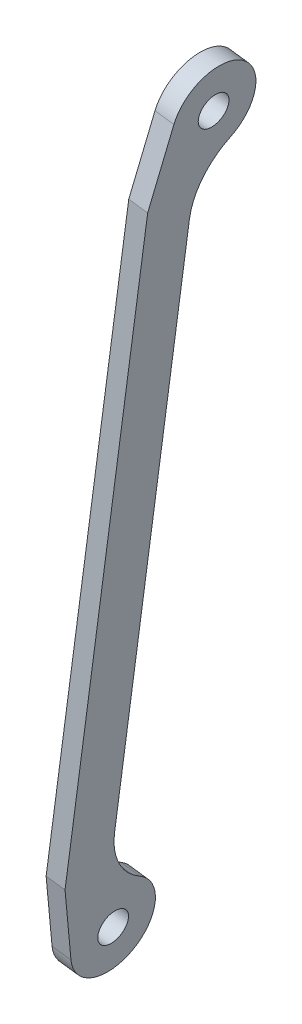
ISO-10303-21;
HEADER;
FILE_DESCRIPTION(('STEP AP214'),'2;1');
FILE_NAME('part.step','',(''),(''),'','','');
FILE_SCHEMA(('AUTOMOTIVE_DESIGN { 1 0 10303 214 1 1 1 1 }'));
ENDSEC;
DATA;
#1=APPLICATION_CONTEXT('core data for automotive mechanical design processes');
#2=APPLICATION_PROTOCOL_DEFINITION('international standard','automotive_design',2000,#1);
#3=PRODUCT_CONTEXT('',#1,'mechanical');
#4=PRODUCT('Part','Part','',(#3));
#5=PRODUCT_RELATED_PRODUCT_CATEGORY('part','',(#4));
#6=PRODUCT_DEFINITION_FORMATION('','',#4);
#7=PRODUCT_DEFINITION_CONTEXT('part definition',#1,'design');
#8=PRODUCT_DEFINITION('design','',#6,#7);
#9=PRODUCT_DEFINITION_SHAPE('','',#8);
#10=(LENGTH_UNIT() NAMED_UNIT(*) SI_UNIT(.MILLI.,.METRE.));
#11=(NAMED_UNIT(*) PLANE_ANGLE_UNIT() SI_UNIT($,.RADIAN.));
#12=(NAMED_UNIT(*) SI_UNIT($,.STERADIAN.) SOLID_ANGLE_UNIT());
#13=UNCERTAINTY_MEASURE_WITH_UNIT(LENGTH_MEASURE(1.E-05),#10,'distance_accuracy_value','');
#14=(GEOMETRIC_REPRESENTATION_CONTEXT(3) GLOBAL_UNCERTAINTY_ASSIGNED_CONTEXT((#13)) GLOBAL_UNIT_ASSIGNED_CONTEXT((#10,
#11,#12)) REPRESENTATION_CONTEXT('',''));
#15=CARTESIAN_POINT('',(0.,0.,0.));
#16=DIRECTION('',(0.,0.,1.));
#17=DIRECTION('',(1.,0.,0.));
#18=AXIS2_PLACEMENT_3D('',#15,#16,#17);
#19=CARTESIAN_POINT('',(87.6961179977007,-71.8034695407329,-15.1531103100848));
#20=DIRECTION('',(-0.991444861373949,0.130526192218997,0.));
#21=DIRECTION('',(0.,0.,1.));
#22=AXIS2_PLACEMENT_3D('',#19,#20,#21);
#23=PLANE('',#22);
#24=CARTESIAN_POINT('',(84.4687057995458,-96.3180990185285,0.));
#25=DIRECTION('',(-0.991444861373949,0.130526192218997,0.));
#26=DIRECTION('',(0.,0.,1.));
#27=AXIS2_PLACEMENT_3D('',#24,#25,#26);
#28=CIRCLE('',#27,4.);
#29=CARTESIAN_POINT('',(84.4687057995458,-96.3180990185285,4.));
#30=VERTEX_POINT('',#29);
#31=EDGE_CURVE('E149',#30,#30,#28,.T.);
#32=ORIENTED_EDGE('',*,*,#31,.F.);
#33=EDGE_LOOP('',(#32));
#34=FACE_BOUND('',#33,.T.);
#35=CARTESIAN_POINT('',(87.6961179977007,-71.8034695407329,-15.1531103100848));
#36=DIRECTION('',(0.991444861373949,-0.130526192218997,0.));
#37=DIRECTION('',(0.,0.,1.));
#38=AXIS2_PLACEMENT_3D('',#35,#36,#37);
#39=CIRCLE('',#38,18.);
#40=CARTESIAN_POINT('',(87.696117925,-71.8034700929494,2.84688968991517));
#41=VERTEX_POINT('',#40);
#42=CARTESIAN_POINT('',(85.6928966746381,-87.0194461442093,-5.74773098050502));
#43=VERTEX_POINT('',#42);
#44=EDGE_CURVE('E167',#41,#43,#39,.T.);
#45=ORIENTED_EDGE('',*,*,#44,.T.);
#46=CARTESIAN_POINT('',(84.4687057995458,-96.3180990185285,0.));
#47=DIRECTION('',(-0.991444861373949,0.130526192218997,0.));
#48=DIRECTION('',(0.,0.,1.));
#49=AXIS2_PLACEMENT_3D('',#46,#47,#48);
#50=CIRCLE('',#49,11.0000000000001);
#51=CARTESIAN_POINT('',(84.1724970722622,-98.5680276770371,10.763367568819));
#52=VERTEX_POINT('',#51);
#53=EDGE_CURVE('E103',#43,#52,#50,.T.);
#54=ORIENTED_EDGE('',*,*,#53,.T.);
#55=DIRECTION('',(0.127723485620426,0.970156191200915,0.206115685709511));
#56=VECTOR('',#55,1.);
#57=CARTESIAN_POINT('',(84.1724970722622,-98.5680276770371,10.763367568819));
#58=LINE('',#57,#56);
#59=CARTESIAN_POINT('',(86.7012930468845,-79.359915252399,14.8442499045684));
#60=VERTEX_POINT('',#59);
#61=EDGE_CURVE('E188',#52,#60,#58,.T.);
#62=ORIENTED_EDGE('',*,*,#61,.T.);
#63=DIRECTION('',(0.130526192218997,0.991444861373949,0.));
#64=VECTOR('',#63,1.);
#65=CARTESIAN_POINT('',(86.7012930468845,-79.359915252399,14.8442499045684));
#66=LINE('',#65,#64);
#67=CARTESIAN_POINT('',(108.368640955238,85.2199317356766,14.8442499045684));
#68=VERTEX_POINT('',#67);
#69=EDGE_CURVE('E202',#60,#68,#66,.T.);
#70=ORIENTED_EDGE('',*,*,#69,.T.);
#71=DIRECTION('',(0.127331001725769,0.967174980043877,-0.21990764874519));
#72=VECTOR('',#71,1.);
#73=CARTESIAN_POINT('',(108.368640955238,85.2199317356766,14.8442499045684));
#74=LINE('',#73,#72);
#75=CARTESIAN_POINT('',(110.889666168954,104.369019371201,10.4903005940179));
#76=VERTEX_POINT('',#75);
#77=EDGE_CURVE('E122',#68,#76,#74,.T.);
#78=ORIENTED_EDGE('',*,*,#77,.T.);
#79=CARTESIAN_POINT('',(110.573925380618,101.970729979623,-0.240427049009332));
#80=DIRECTION('',(-0.991444861373949,0.130526192218997,0.));
#81=DIRECTION('',(0.,0.,1.));
#82=AXIS2_PLACEMENT_3D('',#79,#80,#81);
#83=CIRCLE('',#82,11.0000000000001);
#84=CARTESIAN_POINT('',(109.342518624502,92.6172670473448,-5.89696031378309));
#85=VERTEX_POINT('',#84);
#86=EDGE_CURVE('E116',#76,#85,#83,.T.);
#87=ORIENTED_EDGE('',*,*,#86,.T.);
#88=CARTESIAN_POINT('',(107.327489387223,77.3116004308897,-15.1531056561401));
#89=DIRECTION('',(0.991444861373949,-0.130526192218997,0.));
#90=DIRECTION('',(0.,0.,1.));
#91=AXIS2_PLACEMENT_3D('',#88,#89,#90);
#92=CIRCLE('',#91,18.);
#93=CARTESIAN_POINT('',(107.327489314522,77.3115998786733,2.84689434385985));
#94=VERTEX_POINT('',#93);
#95=EDGE_CURVE('E120',#85,#94,#92,.T.);
#96=ORIENTED_EDGE('',*,*,#95,.T.);
#97=DIRECTION('',(-0.130526192218997,-0.991444861373949,-3.09434152639009E-08));
#98=VECTOR('',#97,1.);
#99=CARTESIAN_POINT('',(107.327489314522,77.3115998786733,2.84689434385985));
#100=LINE('',#99,#98);
#101=EDGE_CURVE('E60',#94,#41,#100,.T.);
#102=ORIENTED_EDGE('',*,*,#101,.T.);
#103=EDGE_LOOP('',(#45,#54,#62,#70,#78,#87,#96,#102));
#104=FACE_BOUND('',#103,.T.);
#105=CARTESIAN_POINT('',(110.573925380618,101.970729979623,-0.240427049009332));
#106=DIRECTION('',(-0.991444861373949,0.130526192218997,0.));
#107=DIRECTION('',(0.,0.,1.));
#108=AXIS2_PLACEMENT_3D('',#105,#106,#107);
#109=CIRCLE('',#108,3.99999999999999);
#110=CARTESIAN_POINT('',(110.573925380618,101.970729979623,3.75957295099066));
#111=VERTEX_POINT('',#110);
#112=EDGE_CURVE('E216',#111,#111,#109,.T.);
#113=ORIENTED_EDGE('',*,*,#112,.F.);
#114=EDGE_LOOP('',(#113));
#115=FACE_BOUND('',#114,.T.);
#116=ADVANCED_FACE('F42',(#34,#104,#115),#23,.T.);
#117=CARTESIAN_POINT('',(92.6533423045704,-72.4561005018279,-15.1531103100848));
#118=DIRECTION('',(-0.991444861373949,0.130526192218997,0.));
#119=DIRECTION('',(0.,0.,1.));
#120=AXIS2_PLACEMENT_3D('',#117,#118,#119);
#121=PLANE('',#120);
#122=CARTESIAN_POINT('',(92.6533423045704,-72.4561005018279,-15.1531103100848));
#123=DIRECTION('',(0.991444861373949,-0.130526192218997,0.));
#124=DIRECTION('',(0.,0.,1.));
#125=AXIS2_PLACEMENT_3D('',#122,#123,#124);
#126=CIRCLE('',#125,18.);
#127=CARTESIAN_POINT('',(92.6533422318697,-72.4561010540444,2.84688968991517));
#128=VERTEX_POINT('',#127);
#129=CARTESIAN_POINT('',(90.6501209815079,-87.6720771053043,-5.74773098050502));
#130=VERTEX_POINT('',#129);
#131=EDGE_CURVE('E144',#128,#130,#126,.T.);
#132=ORIENTED_EDGE('',*,*,#131,.F.);
#133=DIRECTION('',(-0.130526192218997,-0.991444861373949,-3.09434152639009E-08));
#134=VECTOR('',#133,1.);
#135=CARTESIAN_POINT('',(112.284713621392,76.6589689175783,2.84689434385985));
#136=LINE('',#135,#134);
#137=CARTESIAN_POINT('',(112.284713621392,76.6589689175783,2.84689434385985));
#138=VERTEX_POINT('',#137);
#139=EDGE_CURVE('E95',#138,#128,#136,.T.);
#140=ORIENTED_EDGE('',*,*,#139,.F.);
#141=CARTESIAN_POINT('',(112.284713694092,76.6589694697947,-15.1531056561401));
#142=DIRECTION('',(0.991444861373949,-0.130526192218997,0.));
#143=DIRECTION('',(0.,0.,1.));
#144=AXIS2_PLACEMENT_3D('',#141,#142,#143);
#145=CIRCLE('',#144,18.);
#146=CARTESIAN_POINT('',(114.299742931372,91.9646360862498,-5.89696031378309));
#147=VERTEX_POINT('',#146);
#148=EDGE_CURVE('E89',#147,#138,#145,.T.);
#149=ORIENTED_EDGE('',*,*,#148,.F.);
#150=CARTESIAN_POINT('',(115.531149687488,101.318099018528,-0.240427049009332));
#151=DIRECTION('',(-0.991444861373949,0.130526192218997,0.));
#152=DIRECTION('',(0.,0.,1.));
#153=AXIS2_PLACEMENT_3D('',#150,#151,#152);
#154=CIRCLE('',#153,11.0000000000001);
#155=CARTESIAN_POINT('',(115.846890475824,103.716388410106,10.4903005940179));
#156=VERTEX_POINT('',#155);
#157=EDGE_CURVE('E131',#156,#147,#154,.T.);
#158=ORIENTED_EDGE('',*,*,#157,.F.);
#159=DIRECTION('',(0.127331001725769,0.967174980043877,-0.21990764874519));
#160=VECTOR('',#159,1.);
#161=CARTESIAN_POINT('',(113.325865262108,84.5673007745816,14.8442499045684));
#162=LINE('',#161,#160);
#163=CARTESIAN_POINT('',(113.325865262108,84.5673007745816,14.8442499045684));
#164=VERTEX_POINT('',#163);
#165=EDGE_CURVE('E158',#164,#156,#162,.T.);
#166=ORIENTED_EDGE('',*,*,#165,.F.);
#167=DIRECTION('',(0.130526192218997,0.991444861373949,0.));
#168=VECTOR('',#167,1.);
#169=CARTESIAN_POINT('',(91.6585173537542,-80.0125462134939,14.8442499045684));
#170=LINE('',#169,#168);
#171=CARTESIAN_POINT('',(91.6585173537542,-80.0125462134939,14.8442499045684));
#172=VERTEX_POINT('',#171);
#173=EDGE_CURVE('E155',#172,#164,#170,.T.);
#174=ORIENTED_EDGE('',*,*,#173,.F.);
#175=DIRECTION('',(0.127723485620426,0.970156191200915,0.206115685709511));
#176=VECTOR('',#175,1.);
#177=CARTESIAN_POINT('',(89.1297213791319,-99.2206586381321,10.763367568819));
#178=LINE('',#177,#176);
#179=CARTESIAN_POINT('',(89.1297213791319,-99.2206586381321,10.763367568819));
#180=VERTEX_POINT('',#179);
#181=EDGE_CURVE('E152',#180,#172,#178,.T.);
#182=ORIENTED_EDGE('',*,*,#181,.F.);
#183=CARTESIAN_POINT('',(89.4259301064156,-96.9707299796235,0.));
#184=DIRECTION('',(-0.991444861373949,0.130526192218997,0.));
#185=DIRECTION('',(0.,0.,1.));
#186=AXIS2_PLACEMENT_3D('',#183,#184,#185);
#187=CIRCLE('',#186,11.0000000000001);
#188=EDGE_CURVE('E148',#130,#180,#187,.T.);
#189=ORIENTED_EDGE('',*,*,#188,.F.);
#190=EDGE_LOOP('',(#132,#140,#149,#158,#166,#174,#182,#189));
#191=FACE_BOUND('',#190,.T.);
#192=CARTESIAN_POINT('',(89.4259301064156,-96.9707299796235,0.));
#193=DIRECTION('',(-0.991444861373949,0.130526192218997,0.));
#194=DIRECTION('',(0.,0.,1.));
#195=AXIS2_PLACEMENT_3D('',#192,#193,#194);
#196=CIRCLE('',#195,4.);
#197=CARTESIAN_POINT('',(89.4259301064156,-96.9707299796235,4.));
#198=VERTEX_POINT('',#197);
#199=EDGE_CURVE('E212',#198,#198,#196,.T.);
#200=ORIENTED_EDGE('',*,*,#199,.T.);
#201=EDGE_LOOP('',(#200));
#202=FACE_BOUND('',#201,.T.);
#203=CARTESIAN_POINT('',(115.531149687488,101.318099018528,-0.240427049009332));
#204=DIRECTION('',(-0.991444861373949,0.130526192218997,0.));
#205=DIRECTION('',(0.,0.,1.));
#206=AXIS2_PLACEMENT_3D('',#203,#204,#205);
#207=CIRCLE('',#206,3.99999999999999);
#208=CARTESIAN_POINT('',(115.531149687488,101.318099018528,3.75957295099066));
#209=VERTEX_POINT('',#208);
#210=EDGE_CURVE('E220',#209,#209,#207,.T.);
#211=ORIENTED_EDGE('',*,*,#210,.T.);
#212=EDGE_LOOP('',(#211));
#213=FACE_BOUND('',#212,.T.);
#214=ADVANCED_FACE('F192',(#191,#202,#213),#121,.F.);
#215=CARTESIAN_POINT('',(87.6961179977007,-71.8034695407329,-15.1531103100848));
#216=DIRECTION('',(0.991444861373949,-0.130526192218997,0.));
#217=DIRECTION('',(0.,0.,-1.));
#218=AXIS2_PLACEMENT_3D('',#215,#216,#217);
#219=CYLINDRICAL_SURFACE('',#218,18.);
#220=ORIENTED_EDGE('',*,*,#131,.T.);
#221=DIRECTION('',(0.991444861373949,-0.130526192218997,0.));
#222=VECTOR('',#221,1.);
#223=CARTESIAN_POINT('',(85.6928966746381,-87.0194461442093,-5.74773098050502));
#224=LINE('',#223,#222);
#225=EDGE_CURVE('E11',#43,#130,#224,.T.);
#226=ORIENTED_EDGE('',*,*,#225,.F.);
#227=ORIENTED_EDGE('',*,*,#44,.F.);
#228=DIRECTION('',(0.991444861373949,-0.130526192218997,0.));
#229=VECTOR('',#228,1.);
#230=CARTESIAN_POINT('',(87.696117925,-71.8034700929494,2.84688968991517));
#231=LINE('',#230,#229);
#232=EDGE_CURVE('E140',#41,#128,#231,.T.);
#233=ORIENTED_EDGE('',*,*,#232,.T.);
#234=EDGE_LOOP('',(#220,#226,#227,#233));
#235=FACE_BOUND('',#234,.T.);
#236=ADVANCED_FACE('F44',(#235),#219,.F.);
#237=CARTESIAN_POINT('',(84.4687057995458,-96.3180990185285,0.));
#238=DIRECTION('',(0.991444861373949,-0.130526192218997,0.));
#239=DIRECTION('',(0.,0.,-1.));
#240=AXIS2_PLACEMENT_3D('',#237,#238,#239);
#241=CYLINDRICAL_SURFACE('',#240,11.0000000000001);
#242=ORIENTED_EDGE('',*,*,#188,.T.);
#243=DIRECTION('',(0.991444861373949,-0.130526192218997,0.));
#244=VECTOR('',#243,1.);
#245=CARTESIAN_POINT('',(84.1724970722622,-98.5680276770371,10.763367568819));
#246=LINE('',#245,#244);
#247=EDGE_CURVE('E52',#52,#180,#246,.T.);
#248=ORIENTED_EDGE('',*,*,#247,.F.);
#249=ORIENTED_EDGE('',*,*,#53,.F.);
#250=ORIENTED_EDGE('',*,*,#225,.T.);
#251=EDGE_LOOP('',(#242,#248,#249,#250));
#252=FACE_BOUND('',#251,.T.);
#253=ADVANCED_FACE('F254',(#252),#241,.T.);
#254=CARTESIAN_POINT('',(84.1724970722622,-98.5680276770371,10.763367568819));
#255=DIRECTION('',(0.02690349561227,0.204352337445263,-0.978527630731242));
#256=DIRECTION('',(-0.127723485620426,-0.970156191200915,-0.206115685709511));
#257=AXIS2_PLACEMENT_3D('',#254,#255,#256);
#258=PLANE('',#257);
#259=ORIENTED_EDGE('',*,*,#181,.T.);
#260=DIRECTION('',(0.991444861373949,-0.130526192218997,0.));
#261=VECTOR('',#260,1.);
#262=CARTESIAN_POINT('',(86.7012930468845,-79.359915252399,14.8442499045684));
#263=LINE('',#262,#261);
#264=EDGE_CURVE('E178',#60,#172,#263,.T.);
#265=ORIENTED_EDGE('',*,*,#264,.F.);
#266=ORIENTED_EDGE('',*,*,#61,.F.);
#267=ORIENTED_EDGE('',*,*,#247,.T.);
#268=EDGE_LOOP('',(#259,#265,#266,#267));
#269=FACE_BOUND('',#268,.T.);
#270=ADVANCED_FACE('F186',(#269),#258,.F.);
#271=CARTESIAN_POINT('',(86.7012930468845,-79.359915252399,14.8442499045684));
#272=DIRECTION('',(0.,0.,-1.));
#273=DIRECTION('',(-0.130526192218997,-0.991444861373949,0.));
#274=AXIS2_PLACEMENT_3D('',#271,#272,#273);
#275=PLANE('',#274);
#276=ORIENTED_EDGE('',*,*,#173,.T.);
#277=DIRECTION('',(0.991444861373949,-0.130526192218997,0.));
#278=VECTOR('',#277,1.);
#279=CARTESIAN_POINT('',(108.368640955238,85.2199317356766,14.8442499045684));
#280=LINE('',#279,#278);
#281=EDGE_CURVE('E174',#68,#164,#280,.T.);
#282=ORIENTED_EDGE('',*,*,#281,.F.);
#283=ORIENTED_EDGE('',*,*,#69,.F.);
#284=ORIENTED_EDGE('',*,*,#264,.T.);
#285=EDGE_LOOP('',(#276,#282,#283,#284));
#286=FACE_BOUND('',#285,.T.);
#287=ADVANCED_FACE('F197',(#286),#275,.F.);
#288=CARTESIAN_POINT('',(108.368640955238,85.2199317356766,14.8442499045684));
#289=DIRECTION('',(-0.0287037080305422,-0.218026308325246,-0.975520694820649));
#290=DIRECTION('',(-0.127331001725769,-0.967174980043877,0.21990764874519));
#291=AXIS2_PLACEMENT_3D('',#288,#289,#290);
#292=PLANE('',#291);
#293=ORIENTED_EDGE('',*,*,#165,.T.);
#294=DIRECTION('',(0.991444861373949,-0.130526192218997,0.));
#295=VECTOR('',#294,1.);
#296=CARTESIAN_POINT('',(110.889666168954,104.369019371201,10.4903005940179));
#297=LINE('',#296,#295);
#298=EDGE_CURVE('E133',#76,#156,#297,.T.);
#299=ORIENTED_EDGE('',*,*,#298,.F.);
#300=ORIENTED_EDGE('',*,*,#77,.F.);
#301=ORIENTED_EDGE('',*,*,#281,.T.);
#302=EDGE_LOOP('',(#293,#299,#300,#301));
#303=FACE_BOUND('',#302,.T.);
#304=ADVANCED_FACE('F200',(#303),#292,.F.);
#305=CARTESIAN_POINT('',(110.573925380618,101.970729979623,-0.240427049009332));
#306=DIRECTION('',(0.991444861373949,-0.130526192218997,0.));
#307=DIRECTION('',(0.,0.,-1.));
#308=AXIS2_PLACEMENT_3D('',#305,#306,#307);
#309=CYLINDRICAL_SURFACE('',#308,11.0000000000001);
#310=ORIENTED_EDGE('',*,*,#157,.T.);
#311=DIRECTION('',(0.991444861373949,-0.130526192218997,0.));
#312=VECTOR('',#311,1.);
#313=CARTESIAN_POINT('',(109.342518624502,92.6172670473448,-5.89696031378309));
#314=LINE('',#313,#312);
#315=EDGE_CURVE('E128',#85,#147,#314,.T.);
#316=ORIENTED_EDGE('',*,*,#315,.F.);
#317=ORIENTED_EDGE('',*,*,#86,.F.);
#318=ORIENTED_EDGE('',*,*,#298,.T.);
#319=EDGE_LOOP('',(#310,#316,#317,#318));
#320=FACE_BOUND('',#319,.T.);
#321=ADVANCED_FACE('F129',(#320),#309,.T.);
#322=CARTESIAN_POINT('',(107.327489387223,77.3116004308897,-15.1531056561401));
#323=DIRECTION('',(0.991444861373949,-0.130526192218997,0.));
#324=DIRECTION('',(0.,0.,-1.));
#325=AXIS2_PLACEMENT_3D('',#322,#323,#324);
#326=CYLINDRICAL_SURFACE('',#325,18.);
#327=ORIENTED_EDGE('',*,*,#148,.T.);
#328=DIRECTION('',(0.991444861373949,-0.130526192218997,0.));
#329=VECTOR('',#328,1.);
#330=CARTESIAN_POINT('',(107.327489314522,77.3115998786733,2.84689434385985));
#331=LINE('',#330,#329);
#332=EDGE_CURVE('E134',#94,#138,#331,.T.);
#333=ORIENTED_EDGE('',*,*,#332,.F.);
#334=ORIENTED_EDGE('',*,*,#95,.F.);
#335=ORIENTED_EDGE('',*,*,#315,.T.);
#336=EDGE_LOOP('',(#327,#333,#334,#335));
#337=FACE_BOUND('',#336,.T.);
#338=ADVANCED_FACE('F136',(#337),#326,.F.);
#339=CARTESIAN_POINT('',(107.327489314522,77.3115998786733,2.84689434385985));
#340=DIRECTION('',(-4.03892616864817E-09,-3.06786900567548E-08,0.999999999999999));
#341=DIRECTION('',(0.130526192218997,0.991444861373949,3.09434152639009E-08));
#342=AXIS2_PLACEMENT_3D('',#339,#340,#341);
#343=PLANE('',#342);
#344=ORIENTED_EDGE('',*,*,#139,.T.);
#345=ORIENTED_EDGE('',*,*,#232,.F.);
#346=ORIENTED_EDGE('',*,*,#101,.F.);
#347=ORIENTED_EDGE('',*,*,#332,.T.);
#348=EDGE_LOOP('',(#344,#345,#346,#347));
#349=FACE_BOUND('',#348,.T.);
#350=ADVANCED_FACE('F242',(#349),#343,.F.);
#351=CARTESIAN_POINT('',(84.4687057995458,-96.3180990185285,0.));
#352=DIRECTION('',(0.991444861373949,-0.130526192218997,0.));
#353=DIRECTION('',(0.,0.,-1.));
#354=AXIS2_PLACEMENT_3D('',#351,#352,#353);
#355=CYLINDRICAL_SURFACE('',#354,4.);
#356=ORIENTED_EDGE('',*,*,#31,.T.);
#357=EDGE_LOOP('',(#356));
#358=FACE_BOUND('',#357,.T.);
#359=ORIENTED_EDGE('',*,*,#199,.F.);
#360=EDGE_LOOP('',(#359));
#361=FACE_BOUND('',#360,.T.);
#362=ADVANCED_FACE('F239',(#358,#361),#355,.F.);
#363=CARTESIAN_POINT('',(110.573925380618,101.970729979623,-0.240427049009332));
#364=DIRECTION('',(0.991444861373949,-0.130526192218997,0.));
#365=DIRECTION('',(0.,0.,-1.));
#366=AXIS2_PLACEMENT_3D('',#363,#364,#365);
#367=CYLINDRICAL_SURFACE('',#366,3.99999999999999);
#368=ORIENTED_EDGE('',*,*,#112,.T.);
#369=EDGE_LOOP('',(#368));
#370=FACE_BOUND('',#369,.T.);
#371=ORIENTED_EDGE('',*,*,#210,.F.);
#372=EDGE_LOOP('',(#371));
#373=FACE_BOUND('',#372,.T.);
#374=ADVANCED_FACE('F228',(#370,#373),#367,.F.);
#375=CLOSED_SHELL('',(#116,#214,#236,#253,#270,#287,#304,#321,#338,#350,#362,#374));
#376=MANIFOLD_SOLID_BREP('B2',#375);
#377=ADVANCED_BREP_SHAPE_REPRESENTATION('',(#18,#376),#14);
#378=SHAPE_DEFINITION_REPRESENTATION(#9,#377);
ENDSEC;
END-ISO-10303-21;
